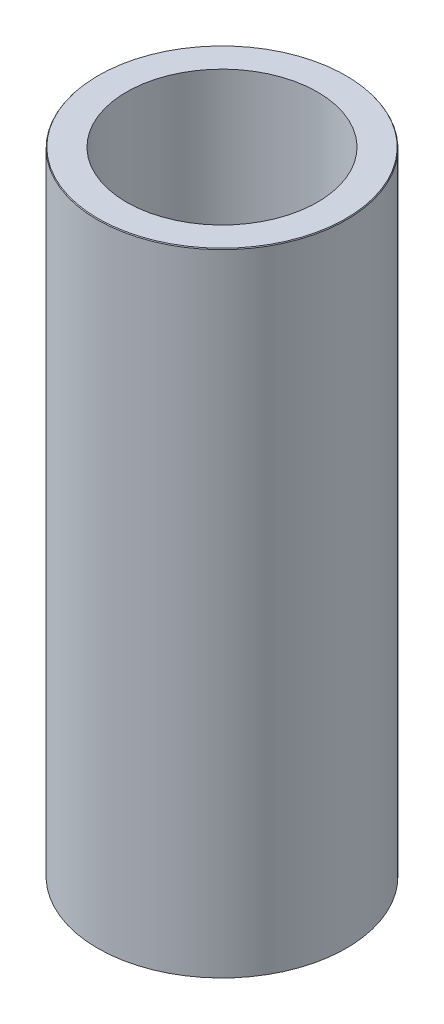
ISO-10303-21;
HEADER;
FILE_DESCRIPTION(('STEP AP214'),'2;1');
FILE_NAME('part.step','',(''),(''),'','','');
FILE_SCHEMA(('AUTOMOTIVE_DESIGN { 1 0 10303 214 1 1 1 1 }'));
ENDSEC;
DATA;
#1=APPLICATION_CONTEXT('core data for automotive mechanical design processes');
#2=APPLICATION_PROTOCOL_DEFINITION('international standard','automotive_design',2000,#1);
#3=PRODUCT_CONTEXT('',#1,'mechanical');
#4=PRODUCT('Part','Part','',(#3));
#5=PRODUCT_RELATED_PRODUCT_CATEGORY('part','',(#4));
#6=PRODUCT_DEFINITION_FORMATION('','',#4);
#7=PRODUCT_DEFINITION_CONTEXT('part definition',#1,'design');
#8=PRODUCT_DEFINITION('design','',#6,#7);
#9=PRODUCT_DEFINITION_SHAPE('','',#8);
#10=(LENGTH_UNIT() NAMED_UNIT(*) SI_UNIT(.MILLI.,.METRE.));
#11=(NAMED_UNIT(*) PLANE_ANGLE_UNIT() SI_UNIT($,.RADIAN.));
#12=(NAMED_UNIT(*) SI_UNIT($,.STERADIAN.) SOLID_ANGLE_UNIT());
#13=UNCERTAINTY_MEASURE_WITH_UNIT(LENGTH_MEASURE(1.E-05),#10,'distance_accuracy_value','');
#14=(GEOMETRIC_REPRESENTATION_CONTEXT(3) GLOBAL_UNCERTAINTY_ASSIGNED_CONTEXT((#13)) GLOBAL_UNIT_ASSIGNED_CONTEXT((#10,
#11,#12)) REPRESENTATION_CONTEXT('',''));
#15=CARTESIAN_POINT('',(0.,0.,0.));
#16=DIRECTION('',(0.,0.,1.));
#17=DIRECTION('',(1.,0.,0.));
#18=AXIS2_PLACEMENT_3D('',#15,#16,#17);
#19=CARTESIAN_POINT('',(0.,266.758775992248,0.));
#20=DIRECTION('',(0.,-1.,0.));
#21=DIRECTION('',(0.,0.,-1.));
#22=AXIS2_PLACEMENT_3D('',#19,#20,#21);
#23=CYLINDRICAL_SURFACE('',#22,52.5);
#24=CARTESIAN_POINT('',(0.,266.387549296012,0.));
#25=DIRECTION('',(0.,1.,0.));
#26=DIRECTION('',(0.,0.,1.));
#27=AXIS2_PLACEMENT_3D('',#24,#25,#26);
#28=CIRCLE('',#27,52.5);
#29=CARTESIAN_POINT('',(0.,266.387549296012,52.5));
#30=VERTEX_POINT('',#29);
#31=EDGE_CURVE('E50',#30,#30,#28,.F.);
#32=ORIENTED_EDGE('',*,*,#31,.T.);
#33=EDGE_LOOP('',(#32));
#34=FACE_BOUND('',#33,.T.);
#35=CARTESIAN_POINT('',(0.,0.228248163241851,0.));
#36=DIRECTION('',(0.,1.,0.));
#37=DIRECTION('',(0.,0.,1.));
#38=AXIS2_PLACEMENT_3D('',#35,#36,#37);
#39=CIRCLE('',#38,52.5);
#40=CARTESIAN_POINT('',(0.,0.228248163241851,52.5));
#41=VERTEX_POINT('',#40);
#42=EDGE_CURVE('E51',#41,#41,#39,.T.);
#43=ORIENTED_EDGE('',*,*,#42,.T.);
#44=EDGE_LOOP('',(#43));
#45=FACE_BOUND('',#44,.T.);
#46=ADVANCED_FACE('F39',(#34,#45),#23,.T.);
#47=CARTESIAN_POINT('',(0.,266.758775992248,0.));
#48=DIRECTION('',(0.,1.,0.));
#49=DIRECTION('',(0.,0.,1.));
#50=AXIS2_PLACEMENT_3D('',#47,#48,#49);
#51=PLANE('',#50);
#52=CARTESIAN_POINT('',(0.,266.758775992248,0.));
#53=DIRECTION('',(0.,1.,0.));
#54=DIRECTION('',(0.,0.,1.));
#55=AXIS2_PLACEMENT_3D('',#52,#53,#54);
#56=CIRCLE('',#55,52.2717518367581);
#57=CARTESIAN_POINT('',(0.,266.758775992248,52.2717518367581));
#58=VERTEX_POINT('',#57);
#59=EDGE_CURVE('E54',#58,#58,#56,.T.);
#60=ORIENTED_EDGE('',*,*,#59,.T.);
#61=EDGE_LOOP('',(#60));
#62=FACE_BOUND('',#61,.T.);
#63=CARTESIAN_POINT('',(0.,266.758775992248,0.));
#64=DIRECTION('',(0.,1.,0.));
#65=DIRECTION('',(0.,0.,1.));
#66=AXIS2_PLACEMENT_3D('',#63,#64,#65);
#67=CIRCLE('',#66,40.2955539236542);
#68=CARTESIAN_POINT('',(0.,266.758775992248,40.2955539236542));
#69=VERTEX_POINT('',#68);
#70=EDGE_CURVE('E58',#69,#69,#67,.T.);
#71=ORIENTED_EDGE('',*,*,#70,.F.);
#72=EDGE_LOOP('',(#71));
#73=FACE_BOUND('',#72,.T.);
#74=ADVANCED_FACE('F69',(#62,#73),#51,.T.);
#75=CARTESIAN_POINT('',(0.,0.,0.));
#76=DIRECTION('',(0.,1.,0.));
#77=DIRECTION('',(0.,0.,1.));
#78=AXIS2_PLACEMENT_3D('',#75,#76,#77);
#79=PLANE('',#78);
#80=CARTESIAN_POINT('',(0.,0.,0.));
#81=DIRECTION('',(0.,1.,0.));
#82=DIRECTION('',(0.,0.,1.));
#83=AXIS2_PLACEMENT_3D('',#80,#81,#82);
#84=CIRCLE('',#83,52.1287733037638);
#85=CARTESIAN_POINT('',(0.,0.,52.1287733037638));
#86=VERTEX_POINT('',#85);
#87=EDGE_CURVE('E10',#86,#86,#84,.F.);
#88=ORIENTED_EDGE('',*,*,#87,.T.);
#89=EDGE_LOOP('',(#88));
#90=FACE_BOUND('',#89,.T.);
#91=CARTESIAN_POINT('',(0.,0.,0.));
#92=DIRECTION('',(0.,1.,0.));
#93=DIRECTION('',(0.,0.,1.));
#94=AXIS2_PLACEMENT_3D('',#91,#92,#93);
#95=CIRCLE('',#94,40.2955539236542);
#96=CARTESIAN_POINT('',(0.,0.,40.2955539236542));
#97=VERTEX_POINT('',#96);
#98=EDGE_CURVE('E63',#97,#97,#95,.T.);
#99=ORIENTED_EDGE('',*,*,#98,.T.);
#100=EDGE_LOOP('',(#99));
#101=FACE_BOUND('',#100,.T.);
#102=ADVANCED_FACE('F75',(#90,#101),#79,.F.);
#103=CARTESIAN_POINT('',(0.,266.758775992248,0.));
#104=DIRECTION('',(0.,-1.,0.));
#105=DIRECTION('',(0.,0.,-1.));
#106=AXIS2_PLACEMENT_3D('',#103,#104,#105);
#107=CYLINDRICAL_SURFACE('',#106,40.2955539236542);
#108=ORIENTED_EDGE('',*,*,#70,.T.);
#109=EDGE_LOOP('',(#108));
#110=FACE_BOUND('',#109,.T.);
#111=ORIENTED_EDGE('',*,*,#98,.F.);
#112=EDGE_LOOP('',(#111));
#113=FACE_BOUND('',#112,.T.);
#114=ADVANCED_FACE('F70',(#110,#113),#107,.F.);
#115=CARTESIAN_POINT('',(0.,266.758775992248,0.));
#116=DIRECTION('',(0.,-1.,0.));
#117=DIRECTION('',(0.,0.,-1.));
#118=AXIS2_PLACEMENT_3D('',#115,#116,#117);
#119=CONICAL_SURFACE('',#118,52.2717518367581,0.551266005690469);
#120=ORIENTED_EDGE('',*,*,#31,.F.);
#121=EDGE_LOOP('',(#120));
#122=FACE_BOUND('',#121,.T.);
#123=ORIENTED_EDGE('',*,*,#59,.F.);
#124=EDGE_LOOP('',(#123));
#125=FACE_BOUND('',#124,.T.);
#126=ADVANCED_FACE('F81',(#122,#125),#119,.T.);
#127=CARTESIAN_POINT('',(0.,0.228248163241851,0.));
#128=DIRECTION('',(0.,1.,0.));
#129=DIRECTION('',(0.,0.,1.));
#130=AXIS2_PLACEMENT_3D('',#127,#128,#129);
#131=CONICAL_SURFACE('',#130,52.5,1.01953032110444);
#132=ORIENTED_EDGE('',*,*,#87,.F.);
#133=EDGE_LOOP('',(#132));
#134=FACE_BOUND('',#133,.T.);
#135=ORIENTED_EDGE('',*,*,#42,.F.);
#136=EDGE_LOOP('',(#135));
#137=FACE_BOUND('',#136,.T.);
#138=ADVANCED_FACE('F45',(#134,#137),#131,.T.);
#139=CLOSED_SHELL('',(#46,#74,#102,#114,#126,#138));
#140=MANIFOLD_SOLID_BREP('B2',#139);
#141=ADVANCED_BREP_SHAPE_REPRESENTATION('',(#18,#140),#14);
#142=SHAPE_DEFINITION_REPRESENTATION(#9,#141);
ENDSEC;
END-ISO-10303-21;
